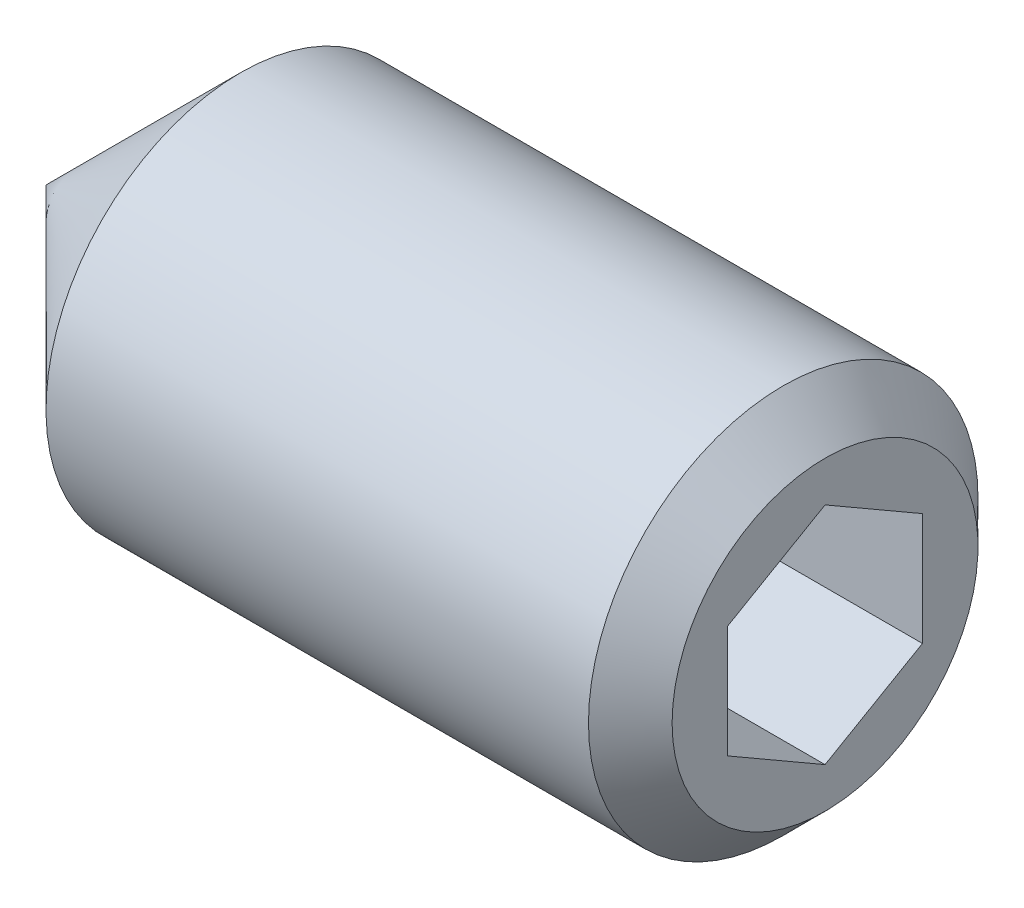
ISO-10303-21;
HEADER;
FILE_DESCRIPTION(('STEP AP214'),'2;1');
FILE_NAME('part.step','',(''),(''),'','','');
FILE_SCHEMA(('AUTOMOTIVE_DESIGN { 1 0 10303 214 1 1 1 1 }'));
ENDSEC;
DATA;
#1=APPLICATION_CONTEXT('core data for automotive mechanical design processes');
#2=APPLICATION_PROTOCOL_DEFINITION('international standard','automotive_design',2000,#1);
#3=PRODUCT_CONTEXT('',#1,'mechanical');
#4=PRODUCT('Part','Part','',(#3));
#5=PRODUCT_RELATED_PRODUCT_CATEGORY('part','',(#4));
#6=PRODUCT_DEFINITION_FORMATION('','',#4);
#7=PRODUCT_DEFINITION_CONTEXT('part definition',#1,'design');
#8=PRODUCT_DEFINITION('design','',#6,#7);
#9=PRODUCT_DEFINITION_SHAPE('','',#8);
#10=(LENGTH_UNIT() NAMED_UNIT(*) SI_UNIT(.MILLI.,.METRE.));
#11=(NAMED_UNIT(*) PLANE_ANGLE_UNIT() SI_UNIT($,.RADIAN.));
#12=(NAMED_UNIT(*) SI_UNIT($,.STERADIAN.) SOLID_ANGLE_UNIT());
#13=UNCERTAINTY_MEASURE_WITH_UNIT(LENGTH_MEASURE(1.E-05),#10,'distance_accuracy_value','');
#14=(GEOMETRIC_REPRESENTATION_CONTEXT(3) GLOBAL_UNCERTAINTY_ASSIGNED_CONTEXT((#13)) GLOBAL_UNIT_ASSIGNED_CONTEXT((#10,
#11,#12)) REPRESENTATION_CONTEXT('',''));
#15=CARTESIAN_POINT('',(0.,0.,0.));
#16=DIRECTION('',(0.,0.,1.));
#17=DIRECTION('',(1.,0.,0.));
#18=AXIS2_PLACEMENT_3D('',#15,#16,#17);
#19=CARTESIAN_POINT('',(7.99999999999999,-0.577350269189614,-0.999999999999998));
#20=DIRECTION('',(0.,0.,-1.));
#21=DIRECTION('',(-1.,0.,0.));
#22=AXIS2_PLACEMENT_3D('',#19,#20,#21);
#23=PLANE('',#22);
#24=DIRECTION('',(1.,0.,0.));
#25=VECTOR('',#24,1.);
#26=CARTESIAN_POINT('',(7.99999999999999,-0.57735026918961,-1.));
#27=LINE('',#26,#25);
#28=CARTESIAN_POINT('',(5.50000000081183,-0.577350269131022,-0.99999999989852));
#29=VERTEX_POINT('',#28);
#30=CARTESIAN_POINT('',(7.99999999999999,-0.577350269189612,-1.));
#31=VERTEX_POINT('',#30);
#32=EDGE_CURVE('E80',#29,#31,#27,.T.);
#33=ORIENTED_EDGE('',*,*,#32,.T.);
#34=DIRECTION('',(0.,1.,0.));
#35=VECTOR('',#34,1.);
#36=CARTESIAN_POINT('',(7.99999999999999,-0.577350269189614,-0.999999999999998));
#37=LINE('',#36,#35);
#38=CARTESIAN_POINT('',(7.99999999999999,0.577350269189633,-0.999999999999996));
#39=VERTEX_POINT('',#38);
#40=EDGE_CURVE('E86',#39,#31,#37,.F.);
#41=ORIENTED_EDGE('',*,*,#40,.F.);
#42=DIRECTION('',(1.,0.,0.));
#43=VECTOR('',#42,1.);
#44=CARTESIAN_POINT('',(7.99999999999999,0.577350269189633,-0.999999999999995));
#45=LINE('',#44,#43);
#46=CARTESIAN_POINT('',(5.50000000084566,0.577350269072451,-0.999999999999997));
#47=VERTEX_POINT('',#46);
#48=EDGE_CURVE('E83',#39,#47,#45,.F.);
#49=ORIENTED_EDGE('',*,*,#48,.T.);
#50=CARTESIAN_POINT('',(5.5000000007136,-0.57735026898361,-1.00000000016254));
#51=CARTESIAN_POINT('',(5.48534777329842,-0.526608173423182,-1.00000000005837));
#52=CARTESIAN_POINT('',(5.4720223392732,-0.475428072822881,-1.00000000001564));
#53=CARTESIAN_POINT('',(5.44876319437732,-0.372181722417922,-0.999999999984315));
#54=CARTESIAN_POINT('',(5.4388377108124,-0.320113638722575,-0.999999999995846));
#55=CARTESIAN_POINT('',(5.42338798007484,-0.21662272499206,-1.00000000000405));
#56=CARTESIAN_POINT('',(5.41776089439144,-0.16521581390017,-1.00000000000108));
#57=CARTESIAN_POINT('',(5.41104458465456,-0.0621602314121982,-0.99999999999892));
#58=CARTESIAN_POINT('',(5.40994979758151,-0.0105119343381249,-0.999999999999728));
#59=CARTESIAN_POINT('',(5.41223314569539,0.0859873679997812,-1.00000000000023));
#60=CARTESIAN_POINT('',(5.41505064323893,0.130852853770375,-1.00000000000006));
#61=CARTESIAN_POINT('',(5.42397865101879,0.220291541304998,-0.999999999999934));
#62=CARTESIAN_POINT('',(5.43009220806019,0.264864433955374,-0.99999999999998));
#63=CARTESIAN_POINT('',(5.44537491738094,0.354487373620654,-1.00000000000002));
#64=CARTESIAN_POINT('',(5.45460882184102,0.399526083365095,-1.00000000000001));
#65=CARTESIAN_POINT('',(5.47556588119387,0.48893194478139,-0.999999999999989));
#66=CARTESIAN_POINT('',(5.48728411517248,0.533300240962124,-0.999999999999979));
#67=CARTESIAN_POINT('',(5.50000000081929,0.577350268981121,-0.999999999999998));
#68=B_SPLINE_CURVE_WITH_KNOTS('',3,(#50,#51,#52,#53,#54,#55,#56,#57,#58,#59,#60,#61,#62,#63,#64,
#65,#66,#67),.UNSPECIFIED.,.F.,.F.,(4,2,2,2,2,2,2,2,4),(0.,0.158508005816843,0.317396908596236,
0.472353803183657,0.627120444577883,0.761853891320366,0.896712096778358,1.03456081101129,
1.17213898640794),.UNSPECIFIED.);
#69=EDGE_CURVE('E23',#29,#47,#68,.T.);
#70=ORIENTED_EDGE('',*,*,#69,.F.);
#71=EDGE_LOOP('',(#33,#41,#49,#70));
#72=FACE_BOUND('',#71,.T.);
#73=ADVANCED_FACE('F19',(#72),#23,.F.);
#74=CARTESIAN_POINT('',(7.99999999999999,-1.15470053837924,0.));
#75=DIRECTION('',(0.,-0.866025403784437,-0.500000000000003));
#76=DIRECTION('',(0.,0.500000000000003,-0.866025403784437));
#77=AXIS2_PLACEMENT_3D('',#74,#75,#76);
#78=PLANE('',#77);
#79=DIRECTION('',(1.,0.,0.));
#80=VECTOR('',#79,1.);
#81=CARTESIAN_POINT('',(7.99999999999999,-1.15470053837925,0.));
#82=LINE('',#81,#80);
#83=CARTESIAN_POINT('',(5.50000000084566,-1.15470053832066,-1.01476687884439E-10));
#84=VERTEX_POINT('',#83);
#85=CARTESIAN_POINT('',(7.99999999999999,-1.15470053837925,0.));
#86=VERTEX_POINT('',#85);
#87=EDGE_CURVE('E147',#84,#86,#82,.T.);
#88=ORIENTED_EDGE('',*,*,#87,.T.);
#89=DIRECTION('',(0.,0.500000000000003,-0.866025403784437));
#90=VECTOR('',#89,1.);
#91=CARTESIAN_POINT('',(7.99999999999999,-1.15470053837924,0.));
#92=LINE('',#91,#90);
#93=EDGE_CURVE('E96',#31,#86,#92,.F.);
#94=ORIENTED_EDGE('',*,*,#93,.F.);
#95=ORIENTED_EDGE('',*,*,#32,.F.);
#96=CARTESIAN_POINT('',(5.50000000071359,-1.15470053841704,-2.59658595293894E-10));
#97=CARTESIAN_POINT('',(5.48534777329842,-1.12932949054661,-0.0439439440041578));
#98=CARTESIAN_POINT('',(5.47202233927321,-1.10373944020944,-0.0882672112708928));
#99=CARTESIAN_POINT('',(5.44876319437733,-1.05211626497983,-0.177681173553948));
#100=CARTESIAN_POINT('',(5.43883771081241,-1.02608222314214,-0.222773456766258));
#101=CARTESIAN_POINT('',(5.42338798007484,-0.974336766283991,-0.312399217121847));
#102=CARTESIAN_POINT('',(5.41776089439144,-0.948633310735474,-0.356918908056026));
#103=CARTESIAN_POINT('',(5.41104458465456,-0.89710551948962,-0.446167660491332));
#104=CARTESIAN_POINT('',(5.4099497975815,-0.871281370953283,-0.490896397820088));
#105=CARTESIAN_POINT('',(5.41223314569538,-0.823031719784766,-0.574467245092446));
#106=CARTESIAN_POINT('',(5.41505064323892,-0.800598976899317,-0.613321895522827));
#107=CARTESIAN_POINT('',(5.42397865101878,-0.755879633131891,-0.690778071008894));
#108=CARTESIAN_POINT('',(5.43009220806018,-0.733593186806739,-0.729379328364303));
#109=CARTESIAN_POINT('',(5.44537491738093,-0.688781716974126,-0.806995070876302));
#110=CARTESIAN_POINT('',(5.45460882184101,-0.666262362101895,-0.845999737668661));
#111=CARTESIAN_POINT('',(5.47556588119386,-0.621559431393726,-0.923427484902403));
#112=CARTESIAN_POINT('',(5.48728411517247,-0.599375283303349,-0.961851556517549));
#113=CARTESIAN_POINT('',(5.50000000081929,-0.577350269293864,-0.99999999981943));
#114=B_SPLINE_CURVE_WITH_KNOTS('',3,(#96,#97,#98,#99,#100,#101,#102,#103,#104,#105,#106,#107,
#108,#109,#110,#111,#112,#113),.UNSPECIFIED.,.F.,.F.,(4,2,2,2,2,2,2,2,4),(0.,0.15850800581684,
0.31739690859623,0.472353803183648,0.627120444577872,0.76185389132037,0.896712096778375,
1.03456081101132,1.17213898640799),.UNSPECIFIED.);
#115=EDGE_CURVE('E88',#84,#29,#114,.T.);
#116=ORIENTED_EDGE('',*,*,#115,.F.);
#117=EDGE_LOOP('',(#88,#94,#95,#116));
#118=FACE_BOUND('',#117,.T.);
#119=ADVANCED_FACE('F97',(#118),#78,.F.);
#120=CARTESIAN_POINT('',(7.99999999999999,0.577350269189633,-0.999999999999995));
#121=DIRECTION('',(0.,0.86602540378444,-0.499999999999998));
#122=DIRECTION('',(0.,0.499999999999998,0.86602540378444));
#123=AXIS2_PLACEMENT_3D('',#120,#121,#122);
#124=PLANE('',#123);
#125=ORIENTED_EDGE('',*,*,#48,.F.);
#126=DIRECTION('',(0.,0.499999999999998,0.86602540378444));
#127=VECTOR('',#126,1.);
#128=CARTESIAN_POINT('',(7.99999999999999,0.577350269189633,-0.999999999999995));
#129=LINE('',#128,#127);
#130=CARTESIAN_POINT('',(7.99999999999999,1.15470053837925,0.));
#131=VERTEX_POINT('',#130);
#132=EDGE_CURVE('E95',#131,#39,#129,.F.);
#133=ORIENTED_EDGE('',*,*,#132,.F.);
#134=DIRECTION('',(1.,0.,0.));
#135=VECTOR('',#134,1.);
#136=CARTESIAN_POINT('',(7.99999999999999,1.15470053837925,0.));
#137=LINE('',#136,#135);
#138=CARTESIAN_POINT('',(5.50000000565391,1.15470054664881,1.43232914007528E-08));
#139=VERTEX_POINT('',#138);
#140=EDGE_CURVE('E192',#131,#139,#137,.F.);
#141=ORIENTED_EDGE('',*,*,#140,.T.);
#142=CARTESIAN_POINT('',(5.5000000007136,0.577350269433392,-0.999999999902864));
#143=CARTESIAN_POINT('',(5.48534777329589,0.602721317127844,-0.9560560560465));
#144=CARTESIAN_POINT('',(5.47202233926857,0.628311367395487,-0.91173278872924));
#145=CARTESIAN_POINT('',(5.44876319436954,0.679934542580536,-0.822318826398048));
#146=CARTESIAN_POINT('',(5.43883771080366,0.705968584443407,-0.777226543188243));
#147=CARTESIAN_POINT('',(5.42338798006907,0.757714041316552,-0.687600782839493));
#148=CARTESIAN_POINT('',(5.41776089438804,0.783417496855378,-0.643081091910218));
#149=CARTESIAN_POINT('',(5.41104458465402,0.834945288087578,-0.55383233948993));
#150=CARTESIAN_POINT('',(5.40994979758137,0.860769436619942,-0.509103602171286));
#151=CARTESIAN_POINT('',(5.41223314575036,0.909019088939285,-0.425532752907662));
#152=CARTESIAN_POINT('',(5.41505064352981,0.93145183297728,-0.386678100480323));
#153=CARTESIAN_POINT('',(5.42397865210604,0.976171179031019,-0.309221921033738));
#154=CARTESIAN_POINT('',(5.43009220970867,0.998457626489892,-0.270620661714846));
#155=CARTESIAN_POINT('',(5.44537492042883,1.04326909861609,-0.19300491523038));
#156=CARTESIAN_POINT('',(5.45460882573721,1.06578845464707,-0.154000246430984));
#157=CARTESIAN_POINT('',(5.47556588697116,1.11049138763056,-0.0765724952561934));
#158=CARTESIAN_POINT('',(5.48728412198144,1.13267553683767,-0.0381484217067704));
#159=CARTESIAN_POINT('',(5.50000000871356,1.15470055194827,2.35022350720768E-08));
#160=B_SPLINE_CURVE_WITH_KNOTS('',3,(#142,#143,#144,#145,#146,#147,#148,#149,#150,#151,#152,
#153,#154,#155,#156,#157,#158,#159),.UNSPECIFIED.,.F.,.F.,(4,2,2,2,2,2,2,2,4),(0.,
0.158508005844513,0.31739690865513,0.472353803214403,0.627120444577903,0.761853898247278,
0.896712110657789,1.03456083220428,1.17213901485881),.UNSPECIFIED.);
#161=EDGE_CURVE('E142',#47,#139,#160,.T.);
#162=ORIENTED_EDGE('',*,*,#161,.F.);
#163=EDGE_LOOP('',(#125,#133,#141,#162));
#164=FACE_BOUND('',#163,.T.);
#165=ADVANCED_FACE('F148',(#164),#124,.F.);
#166=CARTESIAN_POINT('',(7.99999999999999,-0.577350269189619,0.999999999999995));
#167=DIRECTION('',(0.,-0.86602540378444,0.499999999999998));
#168=DIRECTION('',(0.,-0.499999999999998,-0.86602540378444));
#169=AXIS2_PLACEMENT_3D('',#166,#167,#168);
#170=PLANE('',#169);
#171=DIRECTION('',(1.,0.,0.));
#172=VECTOR('',#171,1.);
#173=CARTESIAN_POINT('',(7.99999999999999,-0.577350269189615,0.999999999999998));
#174=LINE('',#173,#172);
#175=CARTESIAN_POINT('',(5.49999999312318,-0.577350307454531,0.999999962395139));
#176=VERTEX_POINT('',#175);
#177=CARTESIAN_POINT('',(7.99999999999999,-0.577350269189616,0.999999999999998));
#178=VERTEX_POINT('',#177);
#179=EDGE_CURVE('E200',#176,#178,#174,.T.);
#180=ORIENTED_EDGE('',*,*,#179,.T.);
#181=DIRECTION('',(0.,-0.499999999999998,-0.86602540378444));
#182=VECTOR('',#181,1.);
#183=CARTESIAN_POINT('',(7.99999999999999,-0.577350269189619,0.999999999999995));
#184=LINE('',#183,#182);
#185=EDGE_CURVE('E193',#86,#178,#184,.F.);
#186=ORIENTED_EDGE('',*,*,#185,.F.);
#187=ORIENTED_EDGE('',*,*,#87,.F.);
#188=CARTESIAN_POINT('',(5.50000000071359,-1.15470053841705,2.59634997034582E-10));
#189=CARTESIAN_POINT('',(5.48534777330644,-1.12932949056068,0.0439439439797638));
#190=CARTESIAN_POINT('',(5.47202233928791,-1.10373944023777,0.0882672112218256));
#191=CARTESIAN_POINT('',(5.448763194402,-1.05211626503888,0.177681173451672));
#192=CARTESIAN_POINT('',(5.43883771084012,-1.02608222321769,0.222773456635399));
#193=CARTESIAN_POINT('',(5.42338798009312,-0.974336766362026,0.312399216986682));
#194=CARTESIAN_POINT('',(5.41776089440221,-0.948633310799109,0.356918907945803));
#195=CARTESIAN_POINT('',(5.4110445846563,-0.897105519521847,0.446167660435511));
#196=CARTESIAN_POINT('',(5.40994979758196,-0.871281370968494,0.49089639779374));
#197=CARTESIAN_POINT('',(5.41223314552128,-0.823031723441933,0.574467238758047));
#198=CARTESIAN_POINT('',(5.41505064231769,-0.800598984207608,0.613321882864497));
#199=CARTESIAN_POINT('',(5.4239786475754,-0.755879647681761,0.690778045807781));
#200=CARTESIAN_POINT('',(5.43009220283934,-0.733593204946921,0.729379296944589));
#201=CARTESIAN_POINT('',(5.44537490772813,-0.688781742378036,0.806995026875443));
#202=CARTESIAN_POINT('',(5.45460880950159,-0.666262391175656,0.845999687311433));
#203=CARTESIAN_POINT('',(5.47556586289689,-0.621559467673664,0.923427422063712));
#204=CARTESIAN_POINT('',(5.48728409360815,-0.599375323120096,0.961851487552927));
#205=CARTESIAN_POINT('',(5.49999997581774,-0.577350312597823,0.99999992481478));
#206=B_SPLINE_CURVE_WITH_KNOTS('',3,(#188,#189,#190,#191,#192,#193,#194,#195,#196,#197,#198,
#199,#200,#201,#202,#203,#204,#205),.UNSPECIFIED.,.F.,.F.,(4,2,2,2,2,2,2,2,4),(0.,
0.158508005729215,0.317396908409727,0.472353803086294,0.627120444577836,0.76185386938252,
0.896712052821551,1.03456074389209,1.17213889630271),.UNSPECIFIED.);
#207=EDGE_CURVE('E91',#84,#176,#206,.T.);
#208=ORIENTED_EDGE('',*,*,#207,.T.);
#209=EDGE_LOOP('',(#180,#186,#187,#208));
#210=FACE_BOUND('',#209,.T.);
#211=ADVANCED_FACE('F151',(#210),#170,.F.);
#212=CARTESIAN_POINT('',(7.99999999999999,1.15470053837925,0.));
#213=DIRECTION('',(0.,0.866025403784437,0.500000000000003));
#214=DIRECTION('',(0.,-0.500000000000003,0.866025403784437));
#215=AXIS2_PLACEMENT_3D('',#212,#213,#214);
#216=PLANE('',#215);
#217=ORIENTED_EDGE('',*,*,#140,.F.);
#218=DIRECTION('',(0.,-0.500000000000003,0.866025403784437));
#219=VECTOR('',#218,1.);
#220=CARTESIAN_POINT('',(7.99999999999999,1.15470053837925,0.));
#221=LINE('',#220,#219);
#222=CARTESIAN_POINT('',(7.99999999999999,0.577350269189628,0.999999999999998));
#223=VERTEX_POINT('',#222);
#224=EDGE_CURVE('E183',#223,#131,#221,.F.);
#225=ORIENTED_EDGE('',*,*,#224,.F.);
#226=DIRECTION('',(1.,0.,0.));
#227=VECTOR('',#226,1.);
#228=CARTESIAN_POINT('',(7.99999999999999,0.577350269189628,0.999999999999998));
#229=LINE('',#228,#227);
#230=CARTESIAN_POINT('',(5.49999998834157,0.577350290905933,0.999999962386253));
#231=VERTEX_POINT('',#230);
#232=EDGE_CURVE('E114',#223,#231,#229,.F.);
#233=ORIENTED_EDGE('',*,*,#232,.T.);
#234=CARTESIAN_POINT('',(5.49999997570568,0.577350312748499,0.999999924878064));
#235=CARTESIAN_POINT('',(5.48534775034439,0.602721359707768,0.956055982295603));
#236=CARTESIAN_POINT('',(5.47202231850089,0.628311409235352,0.911732716260381));
#237=CARTESIAN_POINT('',(5.4487631781332,0.679934582867139,0.822318756619679));
#238=CARTESIAN_POINT('',(5.43883769691191,0.70596862391633,0.77722647481915));
#239=CARTESIAN_POINT('',(5.42338797080749,0.757714079203742,0.68760071721693));
#240=CARTESIAN_POINT('',(5.41776088742773,0.783417533973856,0.64308102761912));
#241=CARTESIAN_POINT('',(5.41104458214332,0.834945323579891,0.553832278015446));
#242=CARTESIAN_POINT('',(5.40994979722097,0.860769471254984,0.509103542181635));
#243=CARTESIAN_POINT('',(5.41223314873345,0.909019115103562,0.425532707589804));
#244=CARTESIAN_POINT('',(5.41505064669284,0.931451851553124,0.386678068306017));
#245=CARTESIAN_POINT('',(5.42397865334506,0.976171182500794,0.309221915023913));
#246=CARTESIAN_POINT('',(5.43009220883848,0.99845762244228,0.270620668725516));
#247=CARTESIAN_POINT('',(5.44537491332725,1.04326907932501,0.193004948643515));
#248=CARTESIAN_POINT('',(5.45460881444117,1.0657884276367,0.154000293214323));
#249=CARTESIAN_POINT('',(5.47556586583027,1.11049134544634,0.0765725683214103));
#250=CARTESIAN_POINT('',(5.48728409519759,1.13267548719795,0.0381485076852834));
#251=CARTESIAN_POINT('',(5.49999997581279,1.15470049496247,7.5200080159464E-08));
#252=B_SPLINE_CURVE_WITH_KNOTS('',3,(#234,#235,#236,#237,#238,#239,#240,#241,#242,#243,#244,
#245,#246,#247,#248,#249,#250,#251),.UNSPECIFIED.,.F.,.F.,(4,2,2,2,2,2,2,2,4),(0.,
0.158507999885474,0.317396896571058,0.472353785793862,0.627120421888203,0.761853830294426,
0.896711997271681,1.03456067098814,1.17213880615555),.UNSPECIFIED.);
#253=EDGE_CURVE('E138',#231,#139,#252,.T.);
#254=ORIENTED_EDGE('',*,*,#253,.T.);
#255=EDGE_LOOP('',(#217,#225,#233,#254));
#256=FACE_BOUND('',#255,.T.);
#257=ADVANCED_FACE('F126',(#256),#216,.F.);
#258=CARTESIAN_POINT('',(5.50400000059881,0.,0.));
#259=DIRECTION('',(1.,0.,0.));
#260=DIRECTION('',(0.,0.,-1.));
#261=AXIS2_PLACEMENT_3D('',#258,#259,#260);
#262=CONICAL_SURFACE('',#261,1.1616287411016,1.0471975498349);
#263=CARTESIAN_POINT('',(4.83333333227165,-1.13686837721616E-10,0.));
#264=VERTEX_POINT('',#263);
#265=VERTEX_LOOP('',#264);
#266=FACE_BOUND('',#265,.T.);
#267=ORIENTED_EDGE('',*,*,#207,.F.);
#268=ORIENTED_EDGE('',*,*,#115,.T.);
#269=ORIENTED_EDGE('',*,*,#69,.T.);
#270=ORIENTED_EDGE('',*,*,#161,.T.);
#271=ORIENTED_EDGE('',*,*,#253,.F.);
#272=CARTESIAN_POINT('',(5.50000003300212,0.577350295758049,0.999999962650109));
#273=CARTESIAN_POINT('',(5.48534778955311,0.526608201315306,0.999999986585592));
#274=CARTESIAN_POINT('',(5.47202234819669,0.475428099558874,0.999999996404711));
#275=CARTESIAN_POINT('',(5.44876319655916,0.372181745000891,1.00000000360392));
#276=CARTESIAN_POINT('',(5.43883771358784,0.320113658307022,1.00000000095407));
#277=CARTESIAN_POINT('',(5.42338798238999,0.21662273952637,0.999999999069537));
#278=CARTESIAN_POINT('',(5.41776089566049,0.165215826377389,0.999999999751967));
#279=CARTESIAN_POINT('',(5.41104458472644,0.0621602394927192,1.00000000024772));
#280=CARTESIAN_POINT('',(5.40994979750956,0.0105119400787099,1.00000000006212));
#281=CARTESIAN_POINT('',(5.41223314561776,-0.085987367078334,0.999999999945917));
#282=CARTESIAN_POINT('',(5.41505064330434,-0.130852855332066,0.999999999985421));
#283=CARTESIAN_POINT('',(5.42397865175246,-0.220291547747137,1.00000000001459));
#284=CARTESIAN_POINT('',(5.43009220931564,-0.264864442795173,1.00000000000421));
#285=CARTESIAN_POINT('',(5.44537492001685,-0.354487387565683,0.999999999995698));
#286=CARTESIAN_POINT('',(5.45460882536326,-0.399526100012383,0.99999999999785));
#287=CARTESIAN_POINT('',(5.47556588673919,-0.488931966820011,1.00000000000214));
#288=CARTESIAN_POINT('',(5.48728412185788,-0.533300265689085,1.00000000000428));
#289=CARTESIAN_POINT('',(5.5000000087226,-0.577350296358986,0.999999999999998));
#290=B_SPLINE_CURVE_WITH_KNOTS('',3,(#272,#273,#274,#275,#276,#277,#278,#279,#280,#281,#282,
#283,#284,#285,#286,#287,#288,#289),.UNSPECIFIED.,.F.,.F.,(4,2,2,2,2,2,2,2,4),(0.,
0.158508014654461,0.317396925602726,0.472353826830977,0.627120475143619,0.761853929349144,
0.896712142121909,1.03456086482148,1.17213904887704),.UNSPECIFIED.);
#291=EDGE_CURVE('E108',#231,#176,#290,.T.);
#292=ORIENTED_EDGE('',*,*,#291,.T.);
#293=EDGE_LOOP('',(#267,#268,#269,#270,#271,#292));
#294=FACE_BOUND('',#293,.T.);
#295=ADVANCED_FACE('F89',(#266,#294),#262,.F.);
#296=CARTESIAN_POINT('',(7.99999999999999,0.577350269189628,0.999999999999998));
#297=DIRECTION('',(0.,0.,1.));
#298=DIRECTION('',(1.,0.,0.));
#299=AXIS2_PLACEMENT_3D('',#296,#297,#298);
#300=PLANE('',#299);
#301=ORIENTED_EDGE('',*,*,#232,.F.);
#302=DIRECTION('',(0.,1.,0.));
#303=VECTOR('',#302,1.);
#304=CARTESIAN_POINT('',(7.99999999999999,0.,0.999999999999998));
#305=LINE('',#304,#303);
#306=EDGE_CURVE('E107',#223,#178,#305,.F.);
#307=ORIENTED_EDGE('',*,*,#306,.T.);
#308=ORIENTED_EDGE('',*,*,#179,.F.);
#309=ORIENTED_EDGE('',*,*,#291,.F.);
#310=EDGE_LOOP('',(#301,#307,#308,#309));
#311=FACE_BOUND('',#310,.T.);
#312=ADVANCED_FACE('F120',(#311),#300,.F.);
#313=CARTESIAN_POINT('',(7.99999999999999,0.,0.));
#314=DIRECTION('',(-1.,0.,0.));
#315=DIRECTION('',(0.,0.,1.));
#316=AXIS2_PLACEMENT_3D('',#313,#314,#315);
#317=PLANE('',#316);
#318=ORIENTED_EDGE('',*,*,#224,.T.);
#319=ORIENTED_EDGE('',*,*,#132,.T.);
#320=ORIENTED_EDGE('',*,*,#40,.T.);
#321=ORIENTED_EDGE('',*,*,#93,.T.);
#322=ORIENTED_EDGE('',*,*,#185,.T.);
#323=ORIENTED_EDGE('',*,*,#306,.F.);
#324=EDGE_LOOP('',(#318,#319,#320,#321,#322,#323));
#325=FACE_BOUND('',#324,.T.);
#326=CARTESIAN_POINT('',(8.00000000020873,0.,0.));
#327=DIRECTION('',(-1.,0.,0.));
#328=DIRECTION('',(0.,0.,1.));
#329=AXIS2_PLACEMENT_3D('',#326,#327,#328);
#330=CIRCLE('',#329,1.57058500019502);
#331=CARTESIAN_POINT('',(8.00000000020873,0.,1.57058500019502));
#332=VERTEX_POINT('',#331);
#333=EDGE_CURVE('E104',#332,#332,#330,.T.);
#334=ORIENTED_EDGE('',*,*,#333,.F.);
#335=EDGE_LOOP('',(#334));
#336=FACE_BOUND('',#335,.T.);
#337=ADVANCED_FACE('F174',(#325,#336),#317,.F.);
#338=CARTESIAN_POINT('',(1.99999500000558,0.,0.));
#339=DIRECTION('',(1.,0.,0.));
#340=DIRECTION('',(0.,1.,0.));
#341=AXIS2_PLACEMENT_3D('',#338,#339,#340);
#342=CONICAL_SURFACE('',#341,2.00000000006639,0.785399412504716);
#343=CARTESIAN_POINT('',(-3.63797880709171E-09,0.,0.));
#344=VERTEX_POINT('',#343);
#345=VERTEX_LOOP('',#344);
#346=FACE_BOUND('',#345,.T.);
#347=CARTESIAN_POINT('',(1.999995,0.,0.));
#348=DIRECTION('',(1.,0.,0.));
#349=DIRECTION('',(0.,1.,0.));
#350=AXIS2_PLACEMENT_3D('',#347,#348,#349);
#351=CIRCLE('',#350,2.);
#352=CARTESIAN_POINT('',(1.999995,2.,0.));
#353=VERTEX_POINT('',#352);
#354=EDGE_CURVE('E33',#353,#353,#351,.T.);
#355=ORIENTED_EDGE('',*,*,#354,.F.);
#356=EDGE_LOOP('',(#355));
#357=FACE_BOUND('',#356,.T.);
#358=ADVANCED_FACE('F168',(#346,#357),#342,.T.);
#359=CARTESIAN_POINT('',(7.57058499982577,0.,0.));
#360=DIRECTION('',(-1.,0.,0.));
#361=DIRECTION('',(0.,0.,1.));
#362=AXIS2_PLACEMENT_3D('',#359,#360,#361);
#363=CONICAL_SURFACE('',#362,1.99999999978218,0.78539816247083);
#364=ORIENTED_EDGE('',*,*,#333,.T.);
#365=EDGE_LOOP('',(#364));
#366=FACE_BOUND('',#365,.T.);
#367=CARTESIAN_POINT('',(7.57058499999999,0.,0.));
#368=DIRECTION('',(1.,0.,0.));
#369=DIRECTION('',(0.,1.,0.));
#370=AXIS2_PLACEMENT_3D('',#367,#368,#369);
#371=CIRCLE('',#370,2.);
#372=CARTESIAN_POINT('',(7.57058499999999,2.,0.));
#373=VERTEX_POINT('',#372);
#374=EDGE_CURVE('E11',#373,#373,#371,.F.);
#375=ORIENTED_EDGE('',*,*,#374,.F.);
#376=EDGE_LOOP('',(#375));
#377=FACE_BOUND('',#376,.T.);
#378=ADVANCED_FACE('F162',(#366,#377),#363,.T.);
#379=CARTESIAN_POINT('',(3.99999999999999,0.,0.));
#380=DIRECTION('',(1.,0.,0.));
#381=DIRECTION('',(0.,1.,0.));
#382=AXIS2_PLACEMENT_3D('',#379,#380,#381);
#383=CYLINDRICAL_SURFACE('',#382,2.);
#384=ORIENTED_EDGE('',*,*,#374,.T.);
#385=EDGE_LOOP('',(#384));
#386=FACE_BOUND('',#385,.T.);
#387=ORIENTED_EDGE('',*,*,#354,.T.);
#388=EDGE_LOOP('',(#387));
#389=FACE_BOUND('',#388,.T.);
#390=ADVANCED_FACE('F160',(#386,#389),#383,.T.);
#391=CLOSED_SHELL('',(#73,#119,#165,#211,#257,#295,#312,#337,#358,#378,#390));
#392=MANIFOLD_SOLID_BREP('B1',#391);
#393=ADVANCED_BREP_SHAPE_REPRESENTATION('',(#18,#392),#14);
#394=SHAPE_DEFINITION_REPRESENTATION(#9,#393);
ENDSEC;
END-ISO-10303-21;
